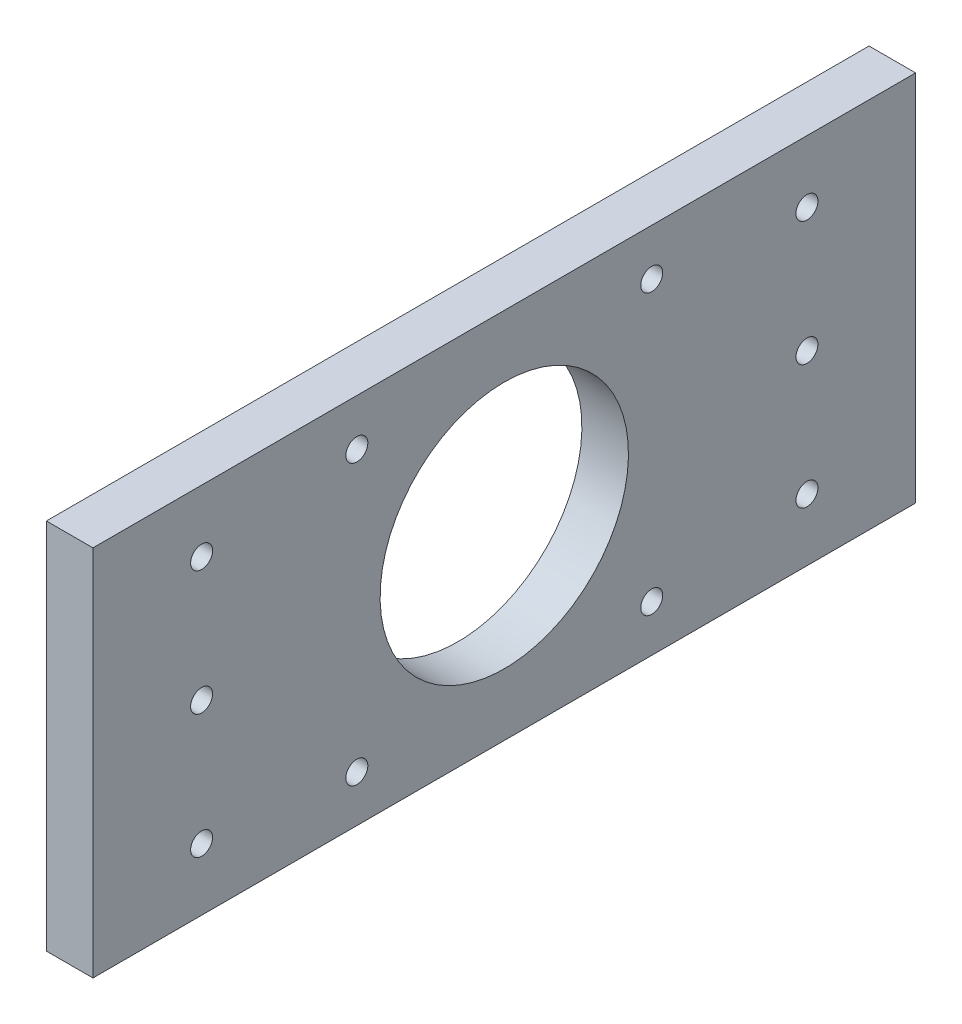
ISO-10303-21;
HEADER;
FILE_DESCRIPTION(('STEP AP214'),'2;1');
FILE_NAME('part.step','',(''),(''),'','','');
FILE_SCHEMA(('AUTOMOTIVE_DESIGN { 1 0 10303 214 1 1 1 1 }'));
ENDSEC;
DATA;
#1=APPLICATION_CONTEXT('core data for automotive mechanical design processes');
#2=APPLICATION_PROTOCOL_DEFINITION('international standard','automotive_design',2000,#1);
#3=PRODUCT_CONTEXT('',#1,'mechanical');
#4=PRODUCT('Part','Part','',(#3));
#5=PRODUCT_RELATED_PRODUCT_CATEGORY('part','',(#4));
#6=PRODUCT_DEFINITION_FORMATION('','',#4);
#7=PRODUCT_DEFINITION_CONTEXT('part definition',#1,'design');
#8=PRODUCT_DEFINITION('design','',#6,#7);
#9=PRODUCT_DEFINITION_SHAPE('','',#8);
#10=(LENGTH_UNIT() NAMED_UNIT(*) SI_UNIT(.MILLI.,.METRE.));
#11=(NAMED_UNIT(*) PLANE_ANGLE_UNIT() SI_UNIT($,.RADIAN.));
#12=(NAMED_UNIT(*) SI_UNIT($,.STERADIAN.) SOLID_ANGLE_UNIT());
#13=UNCERTAINTY_MEASURE_WITH_UNIT(LENGTH_MEASURE(1.E-05),#10,'distance_accuracy_value','');
#14=(GEOMETRIC_REPRESENTATION_CONTEXT(3) GLOBAL_UNCERTAINTY_ASSIGNED_CONTEXT((#13)) GLOBAL_UNIT_ASSIGNED_CONTEXT((#10,
#11,#12)) REPRESENTATION_CONTEXT('',''));
#15=CARTESIAN_POINT('',(0.,0.,0.));
#16=DIRECTION('',(0.,0.,1.));
#17=DIRECTION('',(1.,0.,0.));
#18=AXIS2_PLACEMENT_3D('',#15,#16,#17);
#19=CARTESIAN_POINT('',(4.7625,38.1,168.275));
#20=DIRECTION('',(-1.,0.,0.));
#21=DIRECTION('',(0.,-1.,0.));
#22=AXIS2_PLACEMENT_3D('',#19,#20,#21);
#23=PLANE('',#22);
#24=CARTESIAN_POINT('',(4.7625,0.,84.1375));
#25=DIRECTION('',(1.,0.,0.));
#26=DIRECTION('',(0.,1.,0.));
#27=AXIS2_PLACEMENT_3D('',#24,#25,#26);
#28=CIRCLE('',#27,25.4);
#29=CARTESIAN_POINT('',(4.7625,25.4,84.1375));
#30=VERTEX_POINT('',#29);
#31=EDGE_CURVE('E170',#30,#30,#28,.T.);
#32=ORIENTED_EDGE('',*,*,#31,.F.);
#33=EDGE_LOOP('',(#32));
#34=FACE_BOUND('',#33,.T.);
#35=CARTESIAN_POINT('',(4.7625,28.575,114.3));
#36=DIRECTION('',(1.,0.,0.));
#37=DIRECTION('',(0.,0.,-1.));
#38=AXIS2_PLACEMENT_3D('',#35,#36,#37);
#39=CIRCLE('',#38,2.2479);
#40=CARTESIAN_POINT('',(4.7625,28.575,112.0521));
#41=VERTEX_POINT('',#40);
#42=EDGE_CURVE('E166',#41,#41,#39,.T.);
#43=ORIENTED_EDGE('',*,*,#42,.F.);
#44=EDGE_LOOP('',(#43));
#45=FACE_BOUND('',#44,.T.);
#46=CARTESIAN_POINT('',(4.7625,28.575,53.975));
#47=DIRECTION('',(1.,0.,0.));
#48=DIRECTION('',(0.,0.,-1.));
#49=AXIS2_PLACEMENT_3D('',#46,#47,#48);
#50=CIRCLE('',#49,2.2479);
#51=CARTESIAN_POINT('',(4.7625,28.575,51.7271));
#52=VERTEX_POINT('',#51);
#53=EDGE_CURVE('E160',#52,#52,#50,.T.);
#54=ORIENTED_EDGE('',*,*,#53,.F.);
#55=EDGE_LOOP('',(#54));
#56=FACE_BOUND('',#55,.T.);
#57=CARTESIAN_POINT('',(4.7625,-28.575,53.975));
#58=DIRECTION('',(1.,0.,0.));
#59=DIRECTION('',(0.,0.,-1.));
#60=AXIS2_PLACEMENT_3D('',#57,#58,#59);
#61=CIRCLE('',#60,2.2479);
#62=CARTESIAN_POINT('',(4.7625,-28.575,51.7271));
#63=VERTEX_POINT('',#62);
#64=EDGE_CURVE('E154',#63,#63,#61,.T.);
#65=ORIENTED_EDGE('',*,*,#64,.F.);
#66=EDGE_LOOP('',(#65));
#67=FACE_BOUND('',#66,.T.);
#68=CARTESIAN_POINT('',(4.7625,-28.575,114.3));
#69=DIRECTION('',(1.,0.,0.));
#70=DIRECTION('',(0.,0.,-1.));
#71=AXIS2_PLACEMENT_3D('',#68,#69,#70);
#72=CIRCLE('',#71,2.2479);
#73=CARTESIAN_POINT('',(4.7625,-28.575,112.0521));
#74=VERTEX_POINT('',#73);
#75=EDGE_CURVE('E148',#74,#74,#72,.T.);
#76=ORIENTED_EDGE('',*,*,#75,.F.);
#77=EDGE_LOOP('',(#76));
#78=FACE_BOUND('',#77,.T.);
#79=CARTESIAN_POINT('',(4.7625,25.4,146.05));
#80=DIRECTION('',(1.,0.,0.));
#81=DIRECTION('',(0.,0.,-1.));
#82=AXIS2_PLACEMENT_3D('',#79,#80,#81);
#83=CIRCLE('',#82,2.24789999999999);
#84=CARTESIAN_POINT('',(4.7625,25.4,143.8021));
#85=VERTEX_POINT('',#84);
#86=EDGE_CURVE('E142',#85,#85,#83,.T.);
#87=ORIENTED_EDGE('',*,*,#86,.F.);
#88=EDGE_LOOP('',(#87));
#89=FACE_BOUND('',#88,.T.);
#90=CARTESIAN_POINT('',(4.7625,0.,146.05));
#91=DIRECTION('',(1.,0.,0.));
#92=DIRECTION('',(0.,0.,-1.));
#93=AXIS2_PLACEMENT_3D('',#90,#91,#92);
#94=CIRCLE('',#93,2.24789999999999);
#95=CARTESIAN_POINT('',(4.7625,0.,143.8021));
#96=VERTEX_POINT('',#95);
#97=EDGE_CURVE('E136',#96,#96,#94,.T.);
#98=ORIENTED_EDGE('',*,*,#97,.F.);
#99=EDGE_LOOP('',(#98));
#100=FACE_BOUND('',#99,.T.);
#101=CARTESIAN_POINT('',(4.7625,-25.4,146.05));
#102=DIRECTION('',(1.,0.,0.));
#103=DIRECTION('',(0.,0.,-1.));
#104=AXIS2_PLACEMENT_3D('',#101,#102,#103);
#105=CIRCLE('',#104,2.24789999999999);
#106=CARTESIAN_POINT('',(4.7625,-25.4,143.8021));
#107=VERTEX_POINT('',#106);
#108=EDGE_CURVE('E130',#107,#107,#105,.T.);
#109=ORIENTED_EDGE('',*,*,#108,.F.);
#110=EDGE_LOOP('',(#109));
#111=FACE_BOUND('',#110,.T.);
#112=CARTESIAN_POINT('',(4.7625,25.4,22.225));
#113=DIRECTION('',(1.,0.,0.));
#114=DIRECTION('',(0.,0.,-1.));
#115=AXIS2_PLACEMENT_3D('',#112,#113,#114);
#116=CIRCLE('',#115,2.24789999999999);
#117=CARTESIAN_POINT('',(4.7625,25.4,19.9771));
#118=VERTEX_POINT('',#117);
#119=EDGE_CURVE('E124',#118,#118,#116,.T.);
#120=ORIENTED_EDGE('',*,*,#119,.F.);
#121=EDGE_LOOP('',(#120));
#122=FACE_BOUND('',#121,.T.);
#123=CARTESIAN_POINT('',(4.7625,0.,22.225));
#124=DIRECTION('',(1.,0.,0.));
#125=DIRECTION('',(0.,0.,-1.));
#126=AXIS2_PLACEMENT_3D('',#123,#124,#125);
#127=CIRCLE('',#126,2.24789999999999);
#128=CARTESIAN_POINT('',(4.7625,0.,19.9771));
#129=VERTEX_POINT('',#128);
#130=EDGE_CURVE('E118',#129,#129,#127,.T.);
#131=ORIENTED_EDGE('',*,*,#130,.F.);
#132=EDGE_LOOP('',(#131));
#133=FACE_BOUND('',#132,.T.);
#134=CARTESIAN_POINT('',(4.7625,-25.4,22.225));
#135=DIRECTION('',(1.,0.,0.));
#136=DIRECTION('',(0.,0.,-1.));
#137=AXIS2_PLACEMENT_3D('',#134,#135,#136);
#138=CIRCLE('',#137,2.24789999999999);
#139=CARTESIAN_POINT('',(4.7625,-25.4,19.9771));
#140=VERTEX_POINT('',#139);
#141=EDGE_CURVE('E112',#140,#140,#138,.T.);
#142=ORIENTED_EDGE('',*,*,#141,.F.);
#143=EDGE_LOOP('',(#142));
#144=FACE_BOUND('',#143,.T.);
#145=DIRECTION('',(0.,1.,0.));
#146=VECTOR('',#145,1.);
#147=CARTESIAN_POINT('',(4.7625,38.1,0.));
#148=LINE('',#147,#146);
#149=CARTESIAN_POINT('',(4.7625,-38.1,0.));
#150=VERTEX_POINT('',#149);
#151=CARTESIAN_POINT('',(4.7625,38.1,0.));
#152=VERTEX_POINT('',#151);
#153=EDGE_CURVE('E96',#150,#152,#148,.T.);
#154=ORIENTED_EDGE('',*,*,#153,.T.);
#155=DIRECTION('',(0.,0.,-1.));
#156=VECTOR('',#155,1.);
#157=CARTESIAN_POINT('',(4.7625,38.1,168.275));
#158=LINE('',#157,#156);
#159=CARTESIAN_POINT('',(4.7625,38.1,168.275));
#160=VERTEX_POINT('',#159);
#161=EDGE_CURVE('E11',#160,#152,#158,.T.);
#162=ORIENTED_EDGE('',*,*,#161,.F.);
#163=DIRECTION('',(0.,1.,0.));
#164=VECTOR('',#163,1.);
#165=CARTESIAN_POINT('',(4.7625,38.1,168.275));
#166=LINE('',#165,#164);
#167=CARTESIAN_POINT('',(4.7625,-38.1,168.275));
#168=VERTEX_POINT('',#167);
#169=EDGE_CURVE('E84',#168,#160,#166,.T.);
#170=ORIENTED_EDGE('',*,*,#169,.F.);
#171=DIRECTION('',(0.,0.,-1.));
#172=VECTOR('',#171,1.);
#173=CARTESIAN_POINT('',(4.7625,-38.1,168.275));
#174=LINE('',#173,#172);
#175=EDGE_CURVE('E92',#168,#150,#174,.T.);
#176=ORIENTED_EDGE('',*,*,#175,.T.);
#177=EDGE_LOOP('',(#154,#162,#170,#176));
#178=FACE_BOUND('',#177,.T.);
#179=ADVANCED_FACE('F33',(#34,#45,#56,#67,#78,#89,#100,#111,#122,#133,#144,#178),#23,.F.);
#180=CARTESIAN_POINT('',(-4.7625,38.1,168.275));
#181=DIRECTION('',(0.,-1.,0.));
#182=DIRECTION('',(0.,0.,-1.));
#183=AXIS2_PLACEMENT_3D('',#180,#181,#182);
#184=PLANE('',#183);
#185=DIRECTION('',(-1.,0.,0.));
#186=VECTOR('',#185,1.);
#187=CARTESIAN_POINT('',(-4.7625,38.1,0.));
#188=LINE('',#187,#186);
#189=CARTESIAN_POINT('',(-4.7625,38.1,0.));
#190=VERTEX_POINT('',#189);
#191=EDGE_CURVE('E88',#152,#190,#188,.T.);
#192=ORIENTED_EDGE('',*,*,#191,.T.);
#193=DIRECTION('',(0.,0.,-1.));
#194=VECTOR('',#193,1.);
#195=CARTESIAN_POINT('',(-4.7625,38.1,168.275));
#196=LINE('',#195,#194);
#197=CARTESIAN_POINT('',(-4.7625,38.1,168.275));
#198=VERTEX_POINT('',#197);
#199=EDGE_CURVE('E41',#198,#190,#196,.T.);
#200=ORIENTED_EDGE('',*,*,#199,.F.);
#201=DIRECTION('',(-1.,0.,0.));
#202=VECTOR('',#201,1.);
#203=CARTESIAN_POINT('',(-4.7625,38.1,168.275));
#204=LINE('',#203,#202);
#205=EDGE_CURVE('E79',#160,#198,#204,.T.);
#206=ORIENTED_EDGE('',*,*,#205,.F.);
#207=ORIENTED_EDGE('',*,*,#161,.T.);
#208=EDGE_LOOP('',(#192,#200,#206,#207));
#209=FACE_BOUND('',#208,.T.);
#210=ADVANCED_FACE('F87',(#209),#184,.F.);
#211=CARTESIAN_POINT('',(-4.7625,38.1,168.275));
#212=DIRECTION('',(1.,0.,0.));
#213=DIRECTION('',(0.,1.,0.));
#214=AXIS2_PLACEMENT_3D('',#211,#212,#213);
#215=PLANE('',#214);
#216=CARTESIAN_POINT('',(-4.76250000000002,0.,84.1375));
#217=DIRECTION('',(1.,0.,0.));
#218=DIRECTION('',(0.,1.,0.));
#219=AXIS2_PLACEMENT_3D('',#216,#217,#218);
#220=CIRCLE('',#219,25.4);
#221=CARTESIAN_POINT('',(-4.76250000000003,25.4,84.1375));
#222=VERTEX_POINT('',#221);
#223=EDGE_CURVE('E169',#222,#222,#220,.T.);
#224=ORIENTED_EDGE('',*,*,#223,.T.);
#225=EDGE_LOOP('',(#224));
#226=FACE_BOUND('',#225,.T.);
#227=CARTESIAN_POINT('',(-4.76250000000002,28.575,114.3));
#228=DIRECTION('',(1.,0.,0.));
#229=DIRECTION('',(0.,0.,-1.));
#230=AXIS2_PLACEMENT_3D('',#227,#228,#229);
#231=CIRCLE('',#230,2.2479);
#232=CARTESIAN_POINT('',(-4.76250000000002,28.575,112.0521));
#233=VERTEX_POINT('',#232);
#234=EDGE_CURVE('E163',#233,#233,#231,.T.);
#235=ORIENTED_EDGE('',*,*,#234,.T.);
#236=EDGE_LOOP('',(#235));
#237=FACE_BOUND('',#236,.T.);
#238=CARTESIAN_POINT('',(-4.76250000000002,28.575,53.975));
#239=DIRECTION('',(1.,0.,0.));
#240=DIRECTION('',(0.,0.,-1.));
#241=AXIS2_PLACEMENT_3D('',#238,#239,#240);
#242=CIRCLE('',#241,2.2479);
#243=CARTESIAN_POINT('',(-4.76250000000002,28.575,51.7271));
#244=VERTEX_POINT('',#243);
#245=EDGE_CURVE('E157',#244,#244,#242,.T.);
#246=ORIENTED_EDGE('',*,*,#245,.T.);
#247=EDGE_LOOP('',(#246));
#248=FACE_BOUND('',#247,.T.);
#249=CARTESIAN_POINT('',(-4.76250000000001,-28.575,53.975));
#250=DIRECTION('',(1.,0.,0.));
#251=DIRECTION('',(0.,0.,-1.));
#252=AXIS2_PLACEMENT_3D('',#249,#250,#251);
#253=CIRCLE('',#252,2.2479);
#254=CARTESIAN_POINT('',(-4.76250000000001,-28.575,51.7271));
#255=VERTEX_POINT('',#254);
#256=EDGE_CURVE('E151',#255,#255,#253,.T.);
#257=ORIENTED_EDGE('',*,*,#256,.T.);
#258=EDGE_LOOP('',(#257));
#259=FACE_BOUND('',#258,.T.);
#260=CARTESIAN_POINT('',(-4.76250000000001,-28.575,114.3));
#261=DIRECTION('',(1.,0.,0.));
#262=DIRECTION('',(0.,0.,-1.));
#263=AXIS2_PLACEMENT_3D('',#260,#261,#262);
#264=CIRCLE('',#263,2.2479);
#265=CARTESIAN_POINT('',(-4.76250000000001,-28.575,112.0521));
#266=VERTEX_POINT('',#265);
#267=EDGE_CURVE('E145',#266,#266,#264,.T.);
#268=ORIENTED_EDGE('',*,*,#267,.T.);
#269=EDGE_LOOP('',(#268));
#270=FACE_BOUND('',#269,.T.);
#271=CARTESIAN_POINT('',(-4.76250000000001,25.4,146.05));
#272=DIRECTION('',(1.,0.,0.));
#273=DIRECTION('',(0.,0.,-1.));
#274=AXIS2_PLACEMENT_3D('',#271,#272,#273);
#275=CIRCLE('',#274,2.2479);
#276=CARTESIAN_POINT('',(-4.76250000000001,25.4,143.8021));
#277=VERTEX_POINT('',#276);
#278=EDGE_CURVE('E139',#277,#277,#275,.T.);
#279=ORIENTED_EDGE('',*,*,#278,.T.);
#280=EDGE_LOOP('',(#279));
#281=FACE_BOUND('',#280,.T.);
#282=CARTESIAN_POINT('',(-4.76250000000001,0.,146.05));
#283=DIRECTION('',(1.,0.,0.));
#284=DIRECTION('',(0.,0.,-1.));
#285=AXIS2_PLACEMENT_3D('',#282,#283,#284);
#286=CIRCLE('',#285,2.2479);
#287=CARTESIAN_POINT('',(-4.76250000000001,0.,143.8021));
#288=VERTEX_POINT('',#287);
#289=EDGE_CURVE('E133',#288,#288,#286,.T.);
#290=ORIENTED_EDGE('',*,*,#289,.T.);
#291=EDGE_LOOP('',(#290));
#292=FACE_BOUND('',#291,.T.);
#293=CARTESIAN_POINT('',(-4.76250000000001,-25.4,146.05));
#294=DIRECTION('',(1.,0.,0.));
#295=DIRECTION('',(0.,0.,-1.));
#296=AXIS2_PLACEMENT_3D('',#293,#294,#295);
#297=CIRCLE('',#296,2.2479);
#298=CARTESIAN_POINT('',(-4.76250000000001,-25.4,143.8021));
#299=VERTEX_POINT('',#298);
#300=EDGE_CURVE('E127',#299,#299,#297,.T.);
#301=ORIENTED_EDGE('',*,*,#300,.T.);
#302=EDGE_LOOP('',(#301));
#303=FACE_BOUND('',#302,.T.);
#304=CARTESIAN_POINT('',(-4.76250000000001,25.4,22.225));
#305=DIRECTION('',(1.,0.,0.));
#306=DIRECTION('',(0.,0.,-1.));
#307=AXIS2_PLACEMENT_3D('',#304,#305,#306);
#308=CIRCLE('',#307,2.2479);
#309=CARTESIAN_POINT('',(-4.76250000000001,25.4,19.9771));
#310=VERTEX_POINT('',#309);
#311=EDGE_CURVE('E121',#310,#310,#308,.T.);
#312=ORIENTED_EDGE('',*,*,#311,.T.);
#313=EDGE_LOOP('',(#312));
#314=FACE_BOUND('',#313,.T.);
#315=CARTESIAN_POINT('',(-4.76250000000001,0.,22.225));
#316=DIRECTION('',(1.,0.,0.));
#317=DIRECTION('',(0.,0.,-1.));
#318=AXIS2_PLACEMENT_3D('',#315,#316,#317);
#319=CIRCLE('',#318,2.2479);
#320=CARTESIAN_POINT('',(-4.76250000000001,0.,19.9771));
#321=VERTEX_POINT('',#320);
#322=EDGE_CURVE('E115',#321,#321,#319,.T.);
#323=ORIENTED_EDGE('',*,*,#322,.T.);
#324=EDGE_LOOP('',(#323));
#325=FACE_BOUND('',#324,.T.);
#326=CARTESIAN_POINT('',(-4.76250000000001,-25.4,22.225));
#327=DIRECTION('',(1.,0.,0.));
#328=DIRECTION('',(0.,0.,-1.));
#329=AXIS2_PLACEMENT_3D('',#326,#327,#328);
#330=CIRCLE('',#329,2.2479);
#331=CARTESIAN_POINT('',(-4.76250000000001,-25.4,19.9771));
#332=VERTEX_POINT('',#331);
#333=EDGE_CURVE('E99',#332,#332,#330,.T.);
#334=ORIENTED_EDGE('',*,*,#333,.T.);
#335=EDGE_LOOP('',(#334));
#336=FACE_BOUND('',#335,.T.);
#337=DIRECTION('',(0.,-1.,0.));
#338=VECTOR('',#337,1.);
#339=CARTESIAN_POINT('',(-4.7625,38.1,0.));
#340=LINE('',#339,#338);
#341=CARTESIAN_POINT('',(-4.76249999999999,-38.1,0.));
#342=VERTEX_POINT('',#341);
#343=EDGE_CURVE('E66',#190,#342,#340,.T.);
#344=ORIENTED_EDGE('',*,*,#343,.T.);
#345=DIRECTION('',(0.,0.,-1.));
#346=VECTOR('',#345,1.);
#347=CARTESIAN_POINT('',(-4.76249999999999,-38.1,168.275));
#348=LINE('',#347,#346);
#349=CARTESIAN_POINT('',(-4.76249999999999,-38.1,168.275));
#350=VERTEX_POINT('',#349);
#351=EDGE_CURVE('E89',#350,#342,#348,.T.);
#352=ORIENTED_EDGE('',*,*,#351,.F.);
#353=DIRECTION('',(0.,-1.,0.));
#354=VECTOR('',#353,1.);
#355=CARTESIAN_POINT('',(-4.7625,38.1,168.275));
#356=LINE('',#355,#354);
#357=EDGE_CURVE('E82',#198,#350,#356,.T.);
#358=ORIENTED_EDGE('',*,*,#357,.F.);
#359=ORIENTED_EDGE('',*,*,#199,.T.);
#360=EDGE_LOOP('',(#344,#352,#358,#359));
#361=FACE_BOUND('',#360,.T.);
#362=ADVANCED_FACE('F90',(#226,#237,#248,#259,#270,#281,#292,#303,#314,#325,#336,#361),#215,.F.);
#363=CARTESIAN_POINT('',(-4.76249999999999,-38.1,168.275));
#364=DIRECTION('',(0.,1.,0.));
#365=DIRECTION('',(0.,0.,1.));
#366=AXIS2_PLACEMENT_3D('',#363,#364,#365);
#367=PLANE('',#366);
#368=DIRECTION('',(1.,0.,0.));
#369=VECTOR('',#368,1.);
#370=CARTESIAN_POINT('',(-4.76249999999999,-38.1,0.));
#371=LINE('',#370,#369);
#372=EDGE_CURVE('E72',#342,#150,#371,.T.);
#373=ORIENTED_EDGE('',*,*,#372,.T.);
#374=ORIENTED_EDGE('',*,*,#175,.F.);
#375=DIRECTION('',(1.,0.,0.));
#376=VECTOR('',#375,1.);
#377=CARTESIAN_POINT('',(-4.76249999999999,-38.1,168.275));
#378=LINE('',#377,#376);
#379=EDGE_CURVE('E49',#350,#168,#378,.T.);
#380=ORIENTED_EDGE('',*,*,#379,.F.);
#381=ORIENTED_EDGE('',*,*,#351,.T.);
#382=EDGE_LOOP('',(#373,#374,#380,#381));
#383=FACE_BOUND('',#382,.T.);
#384=ADVANCED_FACE('F104',(#383),#367,.F.);
#385=CARTESIAN_POINT('',(0.,0.,168.275));
#386=DIRECTION('',(0.,0.,1.));
#387=DIRECTION('',(1.,0.,0.));
#388=AXIS2_PLACEMENT_3D('',#385,#386,#387);
#389=PLANE('',#388);
#390=ORIENTED_EDGE('',*,*,#169,.T.);
#391=ORIENTED_EDGE('',*,*,#205,.T.);
#392=ORIENTED_EDGE('',*,*,#357,.T.);
#393=ORIENTED_EDGE('',*,*,#379,.T.);
#394=EDGE_LOOP('',(#390,#391,#392,#393));
#395=FACE_BOUND('',#394,.T.);
#396=ADVANCED_FACE('F80',(#395),#389,.T.);
#397=CARTESIAN_POINT('',(0.,0.,0.));
#398=DIRECTION('',(0.,0.,1.));
#399=DIRECTION('',(1.,0.,0.));
#400=AXIS2_PLACEMENT_3D('',#397,#398,#399);
#401=PLANE('',#400);
#402=ORIENTED_EDGE('',*,*,#153,.F.);
#403=ORIENTED_EDGE('',*,*,#372,.F.);
#404=ORIENTED_EDGE('',*,*,#343,.F.);
#405=ORIENTED_EDGE('',*,*,#191,.F.);
#406=EDGE_LOOP('',(#402,#403,#404,#405));
#407=FACE_BOUND('',#406,.T.);
#408=ADVANCED_FACE('F107',(#407),#401,.F.);
#409=CARTESIAN_POINT('',(4.7625,-25.4,22.225));
#410=DIRECTION('',(1.,0.,0.));
#411=DIRECTION('',(0.,0.,-1.));
#412=AXIS2_PLACEMENT_3D('',#409,#410,#411);
#413=CYLINDRICAL_SURFACE('',#412,2.24789999999999);
#414=ORIENTED_EDGE('',*,*,#333,.F.);
#415=EDGE_LOOP('',(#414));
#416=FACE_BOUND('',#415,.T.);
#417=ORIENTED_EDGE('',*,*,#141,.T.);
#418=EDGE_LOOP('',(#417));
#419=FACE_BOUND('',#418,.T.);
#420=ADVANCED_FACE('F207',(#416,#419),#413,.F.);
#421=CARTESIAN_POINT('',(4.7625,0.,22.225));
#422=DIRECTION('',(1.,0.,0.));
#423=DIRECTION('',(0.,0.,-1.));
#424=AXIS2_PLACEMENT_3D('',#421,#422,#423);
#425=CYLINDRICAL_SURFACE('',#424,2.24789999999999);
#426=ORIENTED_EDGE('',*,*,#322,.F.);
#427=EDGE_LOOP('',(#426));
#428=FACE_BOUND('',#427,.T.);
#429=ORIENTED_EDGE('',*,*,#130,.T.);
#430=EDGE_LOOP('',(#429));
#431=FACE_BOUND('',#430,.T.);
#432=ADVANCED_FACE('F209',(#428,#431),#425,.F.);
#433=CARTESIAN_POINT('',(4.7625,25.4,22.225));
#434=DIRECTION('',(1.,0.,0.));
#435=DIRECTION('',(0.,0.,-1.));
#436=AXIS2_PLACEMENT_3D('',#433,#434,#435);
#437=CYLINDRICAL_SURFACE('',#436,2.24789999999999);
#438=ORIENTED_EDGE('',*,*,#311,.F.);
#439=EDGE_LOOP('',(#438));
#440=FACE_BOUND('',#439,.T.);
#441=ORIENTED_EDGE('',*,*,#119,.T.);
#442=EDGE_LOOP('',(#441));
#443=FACE_BOUND('',#442,.T.);
#444=ADVANCED_FACE('F216',(#440,#443),#437,.F.);
#445=CARTESIAN_POINT('',(4.7625,-25.4,146.05));
#446=DIRECTION('',(1.,0.,0.));
#447=DIRECTION('',(0.,0.,-1.));
#448=AXIS2_PLACEMENT_3D('',#445,#446,#447);
#449=CYLINDRICAL_SURFACE('',#448,2.24789999999999);
#450=ORIENTED_EDGE('',*,*,#300,.F.);
#451=EDGE_LOOP('',(#450));
#452=FACE_BOUND('',#451,.T.);
#453=ORIENTED_EDGE('',*,*,#108,.T.);
#454=EDGE_LOOP('',(#453));
#455=FACE_BOUND('',#454,.T.);
#456=ADVANCED_FACE('F272',(#452,#455),#449,.F.);
#457=CARTESIAN_POINT('',(4.7625,0.,146.05));
#458=DIRECTION('',(1.,0.,0.));
#459=DIRECTION('',(0.,0.,-1.));
#460=AXIS2_PLACEMENT_3D('',#457,#458,#459);
#461=CYLINDRICAL_SURFACE('',#460,2.24789999999999);
#462=ORIENTED_EDGE('',*,*,#289,.F.);
#463=EDGE_LOOP('',(#462));
#464=FACE_BOUND('',#463,.T.);
#465=ORIENTED_EDGE('',*,*,#97,.T.);
#466=EDGE_LOOP('',(#465));
#467=FACE_BOUND('',#466,.T.);
#468=ADVANCED_FACE('F281',(#464,#467),#461,.F.);
#469=CARTESIAN_POINT('',(4.7625,25.4,146.05));
#470=DIRECTION('',(1.,0.,0.));
#471=DIRECTION('',(0.,0.,-1.));
#472=AXIS2_PLACEMENT_3D('',#469,#470,#471);
#473=CYLINDRICAL_SURFACE('',#472,2.24789999999999);
#474=ORIENTED_EDGE('',*,*,#278,.F.);
#475=EDGE_LOOP('',(#474));
#476=FACE_BOUND('',#475,.T.);
#477=ORIENTED_EDGE('',*,*,#86,.T.);
#478=EDGE_LOOP('',(#477));
#479=FACE_BOUND('',#478,.T.);
#480=ADVANCED_FACE('F291',(#476,#479),#473,.F.);
#481=CARTESIAN_POINT('',(4.7625,-28.575,114.3));
#482=DIRECTION('',(1.,0.,0.));
#483=DIRECTION('',(0.,0.,-1.));
#484=AXIS2_PLACEMENT_3D('',#481,#482,#483);
#485=CYLINDRICAL_SURFACE('',#484,2.2479);
#486=ORIENTED_EDGE('',*,*,#267,.F.);
#487=EDGE_LOOP('',(#486));
#488=FACE_BOUND('',#487,.T.);
#489=ORIENTED_EDGE('',*,*,#75,.T.);
#490=EDGE_LOOP('',(#489));
#491=FACE_BOUND('',#490,.T.);
#492=ADVANCED_FACE('F301',(#488,#491),#485,.F.);
#493=CARTESIAN_POINT('',(4.7625,-28.575,53.975));
#494=DIRECTION('',(1.,0.,0.));
#495=DIRECTION('',(0.,0.,-1.));
#496=AXIS2_PLACEMENT_3D('',#493,#494,#495);
#497=CYLINDRICAL_SURFACE('',#496,2.2479);
#498=ORIENTED_EDGE('',*,*,#256,.F.);
#499=EDGE_LOOP('',(#498));
#500=FACE_BOUND('',#499,.T.);
#501=ORIENTED_EDGE('',*,*,#64,.T.);
#502=EDGE_LOOP('',(#501));
#503=FACE_BOUND('',#502,.T.);
#504=ADVANCED_FACE('F311',(#500,#503),#497,.F.);
#505=CARTESIAN_POINT('',(4.7625,28.575,53.975));
#506=DIRECTION('',(1.,0.,0.));
#507=DIRECTION('',(0.,0.,-1.));
#508=AXIS2_PLACEMENT_3D('',#505,#506,#507);
#509=CYLINDRICAL_SURFACE('',#508,2.2479);
#510=ORIENTED_EDGE('',*,*,#245,.F.);
#511=EDGE_LOOP('',(#510));
#512=FACE_BOUND('',#511,.T.);
#513=ORIENTED_EDGE('',*,*,#53,.T.);
#514=EDGE_LOOP('',(#513));
#515=FACE_BOUND('',#514,.T.);
#516=ADVANCED_FACE('F321',(#512,#515),#509,.F.);
#517=CARTESIAN_POINT('',(4.7625,28.575,114.3));
#518=DIRECTION('',(1.,0.,0.));
#519=DIRECTION('',(0.,0.,-1.));
#520=AXIS2_PLACEMENT_3D('',#517,#518,#519);
#521=CYLINDRICAL_SURFACE('',#520,2.2479);
#522=ORIENTED_EDGE('',*,*,#234,.F.);
#523=EDGE_LOOP('',(#522));
#524=FACE_BOUND('',#523,.T.);
#525=ORIENTED_EDGE('',*,*,#42,.T.);
#526=EDGE_LOOP('',(#525));
#527=FACE_BOUND('',#526,.T.);
#528=ADVANCED_FACE('F181',(#524,#527),#521,.F.);
#529=CARTESIAN_POINT('',(-4.76250000000002,0.,84.1375));
#530=DIRECTION('',(1.,0.,0.));
#531=DIRECTION('',(0.,1.,0.));
#532=AXIS2_PLACEMENT_3D('',#529,#530,#531);
#533=CYLINDRICAL_SURFACE('',#532,25.4);
#534=ORIENTED_EDGE('',*,*,#223,.F.);
#535=EDGE_LOOP('',(#534));
#536=FACE_BOUND('',#535,.T.);
#537=ORIENTED_EDGE('',*,*,#31,.T.);
#538=EDGE_LOOP('',(#537));
#539=FACE_BOUND('',#538,.T.);
#540=ADVANCED_FACE('F178',(#536,#539),#533,.F.);
#541=CLOSED_SHELL('',(#179,#210,#362,#384,#396,#408,#420,#432,#444,#456,#468,#480,#492,#504,
#516,#528,#540));
#542=MANIFOLD_SOLID_BREP('B2',#541);
#543=ADVANCED_BREP_SHAPE_REPRESENTATION('',(#18,#542),#14);
#544=SHAPE_DEFINITION_REPRESENTATION(#9,#543);
ENDSEC;
END-ISO-10303-21;
